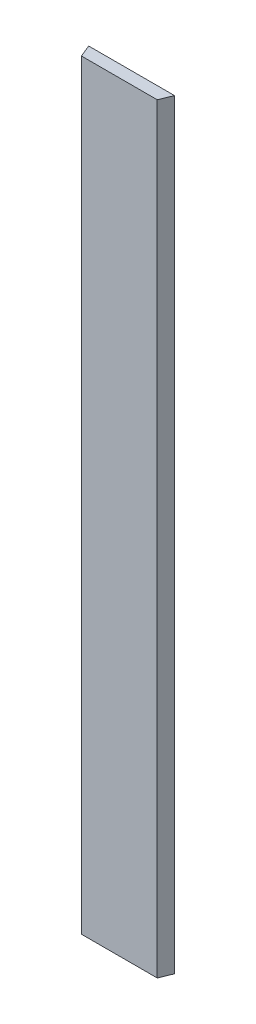
ISO-10303-21;
HEADER;
FILE_DESCRIPTION(('STEP AP214'),'2;1');
FILE_NAME('part.step','',(''),(''),'','','');
FILE_SCHEMA(('AUTOMOTIVE_DESIGN { 1 0 10303 214 1 1 1 1 }'));
ENDSEC;
DATA;
#1=APPLICATION_CONTEXT('core data for automotive mechanical design processes');
#2=APPLICATION_PROTOCOL_DEFINITION('international standard','automotive_design',2000,#1);
#3=PRODUCT_CONTEXT('',#1,'mechanical');
#4=PRODUCT('Part','Part','',(#3));
#5=PRODUCT_RELATED_PRODUCT_CATEGORY('part','',(#4));
#6=PRODUCT_DEFINITION_FORMATION('','',#4);
#7=PRODUCT_DEFINITION_CONTEXT('part definition',#1,'design');
#8=PRODUCT_DEFINITION('design','',#6,#7);
#9=PRODUCT_DEFINITION_SHAPE('','',#8);
#10=(LENGTH_UNIT() NAMED_UNIT(*) SI_UNIT(.MILLI.,.METRE.));
#11=(NAMED_UNIT(*) PLANE_ANGLE_UNIT() SI_UNIT($,.RADIAN.));
#12=(NAMED_UNIT(*) SI_UNIT($,.STERADIAN.) SOLID_ANGLE_UNIT());
#13=UNCERTAINTY_MEASURE_WITH_UNIT(LENGTH_MEASURE(1.E-05),#10,'distance_accuracy_value','');
#14=(GEOMETRIC_REPRESENTATION_CONTEXT(3) GLOBAL_UNCERTAINTY_ASSIGNED_CONTEXT((#13)) GLOBAL_UNIT_ASSIGNED_CONTEXT((#10,
#11,#12)) REPRESENTATION_CONTEXT('',''));
#15=CARTESIAN_POINT('',(0.,0.,0.));
#16=DIRECTION('',(0.,0.,1.));
#17=DIRECTION('',(1.,0.,0.));
#18=AXIS2_PLACEMENT_3D('',#15,#16,#17);
#19=CARTESIAN_POINT('',(-2.055,310.,-5.));
#20=DIRECTION('',(0.924926919497541,0.,-0.380144963913489));
#21=DIRECTION('',(-0.38014496391349,0.,-0.924926919497542));
#22=AXIS2_PLACEMENT_3D('',#19,#20,#21);
#23=PLANE('',#22);
#24=DIRECTION('',(0.38014496391349,0.,0.924926919497542));
#25=VECTOR('',#24,1.);
#26=CARTESIAN_POINT('',(-2.055,0.,-5.));
#27=LINE('',#26,#25);
#28=CARTESIAN_POINT('',(-2.055,0.,-5.));
#29=VERTEX_POINT('',#28);
#30=CARTESIAN_POINT('',(0.,0.,0.));
#31=VERTEX_POINT('',#30);
#32=EDGE_CURVE('E96',#29,#31,#27,.T.);
#33=ORIENTED_EDGE('',*,*,#32,.T.);
#34=DIRECTION('',(0.,-1.,0.));
#35=VECTOR('',#34,1.);
#36=CARTESIAN_POINT('',(0.,310.,0.));
#37=LINE('',#36,#35);
#38=CARTESIAN_POINT('',(0.,310.,0.));
#39=VERTEX_POINT('',#38);
#40=EDGE_CURVE('E11',#39,#31,#37,.T.);
#41=ORIENTED_EDGE('',*,*,#40,.F.);
#42=DIRECTION('',(0.38014496391349,0.,0.924926919497542));
#43=VECTOR('',#42,1.);
#44=CARTESIAN_POINT('',(-2.055,310.,-5.));
#45=LINE('',#44,#43);
#46=CARTESIAN_POINT('',(-2.055,310.,-5.));
#47=VERTEX_POINT('',#46);
#48=EDGE_CURVE('E84',#47,#39,#45,.T.);
#49=ORIENTED_EDGE('',*,*,#48,.F.);
#50=DIRECTION('',(0.,-1.,0.));
#51=VECTOR('',#50,1.);
#52=CARTESIAN_POINT('',(-2.055,310.,-5.));
#53=LINE('',#52,#51);
#54=EDGE_CURVE('E92',#47,#29,#53,.T.);
#55=ORIENTED_EDGE('',*,*,#54,.T.);
#56=EDGE_LOOP('',(#33,#41,#49,#55));
#57=FACE_BOUND('',#56,.T.);
#58=ADVANCED_FACE('F33',(#57),#23,.F.);
#59=CARTESIAN_POINT('',(0.,310.,0.));
#60=DIRECTION('',(0.,0.,-1.));
#61=DIRECTION('',(-1.,0.,0.));
#62=AXIS2_PLACEMENT_3D('',#59,#60,#61);
#63=PLANE('',#62);
#64=DIRECTION('',(1.,0.,0.));
#65=VECTOR('',#64,1.);
#66=CARTESIAN_POINT('',(0.,0.,0.));
#67=LINE('',#66,#65);
#68=CARTESIAN_POINT('',(30.89,0.,0.));
#69=VERTEX_POINT('',#68);
#70=EDGE_CURVE('E88',#31,#69,#67,.T.);
#71=ORIENTED_EDGE('',*,*,#70,.T.);
#72=DIRECTION('',(0.,-1.,0.));
#73=VECTOR('',#72,1.);
#74=CARTESIAN_POINT('',(30.89,310.,0.));
#75=LINE('',#74,#73);
#76=CARTESIAN_POINT('',(30.89,310.,0.));
#77=VERTEX_POINT('',#76);
#78=EDGE_CURVE('E41',#77,#69,#75,.T.);
#79=ORIENTED_EDGE('',*,*,#78,.F.);
#80=DIRECTION('',(1.,0.,0.));
#81=VECTOR('',#80,1.);
#82=CARTESIAN_POINT('',(0.,310.,0.));
#83=LINE('',#82,#81);
#84=EDGE_CURVE('E79',#39,#77,#83,.T.);
#85=ORIENTED_EDGE('',*,*,#84,.F.);
#86=ORIENTED_EDGE('',*,*,#40,.T.);
#87=EDGE_LOOP('',(#71,#79,#85,#86));
#88=FACE_BOUND('',#87,.T.);
#89=ADVANCED_FACE('F87',(#88),#63,.F.);
#90=CARTESIAN_POINT('',(32.945,310.,-5.));
#91=DIRECTION('',(-0.924926919497542,0.,-0.380144963913489));
#92=DIRECTION('',(-0.380144963913489,0.,0.924926919497542));
#93=AXIS2_PLACEMENT_3D('',#90,#91,#92);
#94=PLANE('',#93);
#95=DIRECTION('',(0.380144963913489,0.,-0.924926919497542));
#96=VECTOR('',#95,1.);
#97=CARTESIAN_POINT('',(32.945,0.,-5.));
#98=LINE('',#97,#96);
#99=CARTESIAN_POINT('',(32.945,0.,-5.));
#100=VERTEX_POINT('',#99);
#101=EDGE_CURVE('E66',#69,#100,#98,.T.);
#102=ORIENTED_EDGE('',*,*,#101,.T.);
#103=DIRECTION('',(0.,-1.,0.));
#104=VECTOR('',#103,1.);
#105=CARTESIAN_POINT('',(32.945,310.,-5.));
#106=LINE('',#105,#104);
#107=CARTESIAN_POINT('',(32.945,310.,-5.));
#108=VERTEX_POINT('',#107);
#109=EDGE_CURVE('E89',#108,#100,#106,.T.);
#110=ORIENTED_EDGE('',*,*,#109,.F.);
#111=DIRECTION('',(0.380144963913489,0.,-0.924926919497542));
#112=VECTOR('',#111,1.);
#113=CARTESIAN_POINT('',(32.945,310.,-5.));
#114=LINE('',#113,#112);
#115=EDGE_CURVE('E82',#77,#108,#114,.T.);
#116=ORIENTED_EDGE('',*,*,#115,.F.);
#117=ORIENTED_EDGE('',*,*,#78,.T.);
#118=EDGE_LOOP('',(#102,#110,#116,#117));
#119=FACE_BOUND('',#118,.T.);
#120=ADVANCED_FACE('F90',(#119),#94,.F.);
#121=CARTESIAN_POINT('',(-2.055,310.,-5.));
#122=DIRECTION('',(0.,0.,1.));
#123=DIRECTION('',(1.,0.,0.));
#124=AXIS2_PLACEMENT_3D('',#121,#122,#123);
#125=PLANE('',#124);
#126=DIRECTION('',(-1.,0.,0.));
#127=VECTOR('',#126,1.);
#128=CARTESIAN_POINT('',(-2.055,0.,-5.));
#129=LINE('',#128,#127);
#130=EDGE_CURVE('E72',#100,#29,#129,.T.);
#131=ORIENTED_EDGE('',*,*,#130,.T.);
#132=ORIENTED_EDGE('',*,*,#54,.F.);
#133=DIRECTION('',(-1.,0.,0.));
#134=VECTOR('',#133,1.);
#135=CARTESIAN_POINT('',(-2.055,310.,-5.));
#136=LINE('',#135,#134);
#137=EDGE_CURVE('E49',#108,#47,#136,.T.);
#138=ORIENTED_EDGE('',*,*,#137,.F.);
#139=ORIENTED_EDGE('',*,*,#109,.T.);
#140=EDGE_LOOP('',(#131,#132,#138,#139));
#141=FACE_BOUND('',#140,.T.);
#142=ADVANCED_FACE('F103',(#141),#125,.F.);
#143=CARTESIAN_POINT('',(0.,310.,0.));
#144=DIRECTION('',(0.,1.,0.));
#145=DIRECTION('',(0.,0.,1.));
#146=AXIS2_PLACEMENT_3D('',#143,#144,#145);
#147=PLANE('',#146);
#148=ORIENTED_EDGE('',*,*,#48,.T.);
#149=ORIENTED_EDGE('',*,*,#84,.T.);
#150=ORIENTED_EDGE('',*,*,#115,.T.);
#151=ORIENTED_EDGE('',*,*,#137,.T.);
#152=EDGE_LOOP('',(#148,#149,#150,#151));
#153=FACE_BOUND('',#152,.T.);
#154=ADVANCED_FACE('F80',(#153),#147,.T.);
#155=CARTESIAN_POINT('',(0.,0.,0.));
#156=DIRECTION('',(0.,1.,0.));
#157=DIRECTION('',(0.,0.,1.));
#158=AXIS2_PLACEMENT_3D('',#155,#156,#157);
#159=PLANE('',#158);
#160=ORIENTED_EDGE('',*,*,#32,.F.);
#161=ORIENTED_EDGE('',*,*,#130,.F.);
#162=ORIENTED_EDGE('',*,*,#101,.F.);
#163=ORIENTED_EDGE('',*,*,#70,.F.);
#164=EDGE_LOOP('',(#160,#161,#162,#163));
#165=FACE_BOUND('',#164,.T.);
#166=ADVANCED_FACE('F106',(#165),#159,.F.);
#167=CLOSED_SHELL('',(#58,#89,#120,#142,#154,#166));
#168=MANIFOLD_SOLID_BREP('B2',#167);
#169=ADVANCED_BREP_SHAPE_REPRESENTATION('',(#18,#168),#14);
#170=SHAPE_DEFINITION_REPRESENTATION(#9,#169);
ENDSEC;
END-ISO-10303-21;
